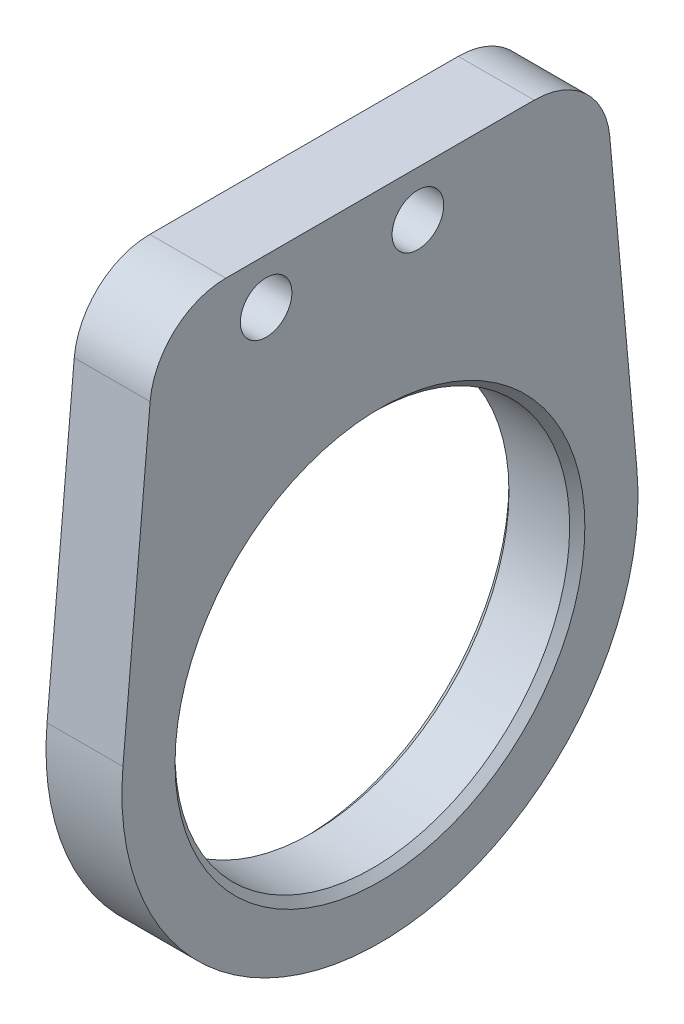
ISO-10303-21;
HEADER;
FILE_DESCRIPTION(('STEP AP214'),'2;1');
FILE_NAME('part.step','',(''),(''),'','','');
FILE_SCHEMA(('AUTOMOTIVE_DESIGN { 1 0 10303 214 1 1 1 1 }'));
ENDSEC;
DATA;
#1=APPLICATION_CONTEXT('core data for automotive mechanical design processes');
#2=APPLICATION_PROTOCOL_DEFINITION('international standard','automotive_design',2000,#1);
#3=PRODUCT_CONTEXT('',#1,'mechanical');
#4=PRODUCT('Part','Part','',(#3));
#5=PRODUCT_RELATED_PRODUCT_CATEGORY('part','',(#4));
#6=PRODUCT_DEFINITION_FORMATION('','',#4);
#7=PRODUCT_DEFINITION_CONTEXT('part definition',#1,'design');
#8=PRODUCT_DEFINITION('design','',#6,#7);
#9=PRODUCT_DEFINITION_SHAPE('','',#8);
#10=(LENGTH_UNIT() NAMED_UNIT(*) SI_UNIT(.MILLI.,.METRE.));
#11=(NAMED_UNIT(*) PLANE_ANGLE_UNIT() SI_UNIT($,.RADIAN.));
#12=(NAMED_UNIT(*) SI_UNIT($,.STERADIAN.) SOLID_ANGLE_UNIT());
#13=UNCERTAINTY_MEASURE_WITH_UNIT(LENGTH_MEASURE(1.E-05),#10,'distance_accuracy_value','');
#14=(GEOMETRIC_REPRESENTATION_CONTEXT(3) GLOBAL_UNCERTAINTY_ASSIGNED_CONTEXT((#13)) GLOBAL_UNIT_ASSIGNED_CONTEXT((#10,
#11,#12)) REPRESENTATION_CONTEXT('',''));
#15=CARTESIAN_POINT('',(0.,0.,0.));
#16=DIRECTION('',(0.,0.,1.));
#17=DIRECTION('',(1.,0.,0.));
#18=AXIS2_PLACEMENT_3D('',#15,#16,#17);
#19=CARTESIAN_POINT('',(0.,0.,0.));
#20=DIRECTION('',(1.,0.,0.));
#21=DIRECTION('',(0.,0.,-1.));
#22=AXIS2_PLACEMENT_3D('',#19,#20,#21);
#23=PLANE('',#22);
#24=CARTESIAN_POINT('',(0.,0.,0.));
#25=DIRECTION('',(1.,0.,0.));
#26=DIRECTION('',(0.,0.,-1.));
#27=AXIS2_PLACEMENT_3D('',#24,#25,#26);
#28=CIRCLE('',#27,13.5);
#29=CARTESIAN_POINT('',(0.,0.,-13.5));
#30=VERTEX_POINT('',#29);
#31=EDGE_CURVE('E145',#30,#30,#28,.T.);
#32=ORIENTED_EDGE('',*,*,#31,.T.);
#33=EDGE_LOOP('',(#32));
#34=FACE_BOUND('',#33,.T.);
#35=CARTESIAN_POINT('',(0.,23.,-2.49999999999997));
#36=DIRECTION('',(-1.,0.,0.));
#37=DIRECTION('',(0.,0.,1.));
#38=AXIS2_PLACEMENT_3D('',#35,#36,#37);
#39=CIRCLE('',#38,1.69999999999999);
#40=CARTESIAN_POINT('',(0.,23.,-0.799999999999981));
#41=VERTEX_POINT('',#40);
#42=EDGE_CURVE('E168',#41,#41,#39,.T.);
#43=ORIENTED_EDGE('',*,*,#42,.F.);
#44=EDGE_LOOP('',(#43));
#45=FACE_BOUND('',#44,.T.);
#46=DIRECTION('',(0.,-0.995979773230106,0.0895784087629744));
#47=VECTOR('',#46,1.);
#48=CARTESIAN_POINT('',(0.,1.52283294897057,16.9316561449118));
#49=LINE('',#48,#47);
#50=CARTESIAN_POINT('',(0.,21.4478920438149,15.1395965708144));
#51=VERTEX_POINT('',#50);
#52=CARTESIAN_POINT('',(0.,1.52283294897056,16.9316561449118));
#53=VERTEX_POINT('',#52);
#54=EDGE_CURVE('E119',#51,#53,#49,.T.);
#55=ORIENTED_EDGE('',*,*,#54,.F.);
#56=CARTESIAN_POINT('',(0.,21.,10.1596977046639));
#57=DIRECTION('',(1.,0.,0.));
#58=DIRECTION('',(0.,0.,-1.));
#59=AXIS2_PLACEMENT_3D('',#56,#57,#58);
#60=CIRCLE('',#59,5.);
#61=CARTESIAN_POINT('',(0.,26.,10.1596977046639));
#62=VERTEX_POINT('',#61);
#63=EDGE_CURVE('E134',#51,#62,#60,.F.);
#64=ORIENTED_EDGE('',*,*,#63,.T.);
#65=DIRECTION('',(0.,0.,-1.));
#66=VECTOR('',#65,1.);
#67=CARTESIAN_POINT('',(0.,26.,0.));
#68=LINE('',#67,#66);
#69=CARTESIAN_POINT('',(0.,26.,-10.1596977046639));
#70=VERTEX_POINT('',#69);
#71=EDGE_CURVE('E189',#62,#70,#68,.T.);
#72=ORIENTED_EDGE('',*,*,#71,.T.);
#73=CARTESIAN_POINT('',(0.,21.,-10.1596977046639));
#74=DIRECTION('',(1.,0.,0.));
#75=DIRECTION('',(0.,0.,-1.));
#76=AXIS2_PLACEMENT_3D('',#73,#74,#75);
#77=CIRCLE('',#76,5.);
#78=CARTESIAN_POINT('',(0.,21.4478920438149,-15.1395965708144));
#79=VERTEX_POINT('',#78);
#80=EDGE_CURVE('E128',#70,#79,#77,.F.);
#81=ORIENTED_EDGE('',*,*,#80,.T.);
#82=DIRECTION('',(0.,-0.995979773230106,-0.0895784087629746));
#83=VECTOR('',#82,1.);
#84=CARTESIAN_POINT('',(0.,1.52283294897057,-16.9316561449118));
#85=LINE('',#84,#83);
#86=CARTESIAN_POINT('',(0.,1.52283294897057,-16.9316561449118));
#87=VERTEX_POINT('',#86);
#88=EDGE_CURVE('E187',#79,#87,#85,.T.);
#89=ORIENTED_EDGE('',*,*,#88,.T.);
#90=CARTESIAN_POINT('',(0.,0.,0.));
#91=DIRECTION('',(1.,0.,0.));
#92=DIRECTION('',(0.,0.,-1.));
#93=AXIS2_PLACEMENT_3D('',#90,#91,#92);
#94=CIRCLE('',#93,17.);
#95=EDGE_CURVE('E123',#53,#87,#94,.T.);
#96=ORIENTED_EDGE('',*,*,#95,.F.);
#97=EDGE_LOOP('',(#55,#64,#72,#81,#89,#96));
#98=FACE_BOUND('',#97,.T.);
#99=CARTESIAN_POINT('',(0.,23.,7.50000000000003));
#100=DIRECTION('',(-1.,0.,0.));
#101=DIRECTION('',(0.,0.,1.));
#102=AXIS2_PLACEMENT_3D('',#99,#100,#101);
#103=CIRCLE('',#102,1.69999999999999);
#104=CARTESIAN_POINT('',(0.,23.,9.20000000000002));
#105=VERTEX_POINT('',#104);
#106=EDGE_CURVE('E173',#105,#105,#103,.T.);
#107=ORIENTED_EDGE('',*,*,#106,.F.);
#108=EDGE_LOOP('',(#107));
#109=FACE_BOUND('',#108,.T.);
#110=ADVANCED_FACE('F49',(#34,#45,#98,#109),#23,.F.);
#111=CARTESIAN_POINT('',(5.,0.,0.));
#112=DIRECTION('',(-1.,0.,0.));
#113=DIRECTION('',(0.,0.,1.));
#114=AXIS2_PLACEMENT_3D('',#111,#112,#113);
#115=CYLINDRICAL_SURFACE('',#114,17.);
#116=ORIENTED_EDGE('',*,*,#95,.T.);
#117=DIRECTION('',(-1.,0.,0.));
#118=VECTOR('',#117,1.);
#119=CARTESIAN_POINT('',(5.,1.52283294897057,-16.9316561449118));
#120=LINE('',#119,#118);
#121=CARTESIAN_POINT('',(5.,1.52283294897057,-16.9316561449118));
#122=VERTEX_POINT('',#121);
#123=EDGE_CURVE('E107',#122,#87,#120,.T.);
#124=ORIENTED_EDGE('',*,*,#123,.F.);
#125=CARTESIAN_POINT('',(5.,0.,0.));
#126=DIRECTION('',(1.,0.,0.));
#127=DIRECTION('',(0.,0.,-1.));
#128=AXIS2_PLACEMENT_3D('',#125,#126,#127);
#129=CIRCLE('',#128,17.);
#130=CARTESIAN_POINT('',(5.,1.52283294897056,16.9316561449118));
#131=VERTEX_POINT('',#130);
#132=EDGE_CURVE('E110',#131,#122,#129,.T.);
#133=ORIENTED_EDGE('',*,*,#132,.F.);
#134=DIRECTION('',(-1.,0.,0.));
#135=VECTOR('',#134,1.);
#136=CARTESIAN_POINT('',(5.,1.52283294897056,16.9316561449118));
#137=LINE('',#136,#135);
#138=EDGE_CURVE('E125',#131,#53,#137,.T.);
#139=ORIENTED_EDGE('',*,*,#138,.T.);
#140=EDGE_LOOP('',(#116,#124,#133,#139));
#141=FACE_BOUND('',#140,.T.);
#142=ADVANCED_FACE('F121',(#141),#115,.T.);
#143=CARTESIAN_POINT('',(5.,1.52283294897057,-16.9316561449118));
#144=DIRECTION('',(0.,0.0895784087629746,-0.995979773230106));
#145=DIRECTION('',(0.,0.995979773230106,0.0895784087629746));
#146=AXIS2_PLACEMENT_3D('',#143,#144,#145);
#147=PLANE('',#146);
#148=ORIENTED_EDGE('',*,*,#88,.F.);
#149=DIRECTION('',(-1.,0.,0.));
#150=VECTOR('',#149,1.);
#151=CARTESIAN_POINT('',(5.,21.4478920438149,-15.1395965708144));
#152=LINE('',#151,#150);
#153=CARTESIAN_POINT('',(5.,21.4478920438149,-15.1395965708144));
#154=VERTEX_POINT('',#153);
#155=EDGE_CURVE('E65',#79,#154,#152,.F.);
#156=ORIENTED_EDGE('',*,*,#155,.T.);
#157=DIRECTION('',(0.,-0.995979773230106,-0.0895784087629746));
#158=VECTOR('',#157,1.);
#159=CARTESIAN_POINT('',(5.,1.52283294897057,-16.9316561449118));
#160=LINE('',#159,#158);
#161=EDGE_CURVE('E103',#154,#122,#160,.T.);
#162=ORIENTED_EDGE('',*,*,#161,.T.);
#163=ORIENTED_EDGE('',*,*,#123,.T.);
#164=EDGE_LOOP('',(#148,#156,#162,#163));
#165=FACE_BOUND('',#164,.T.);
#166=ADVANCED_FACE('F105',(#165),#147,.T.);
#167=CARTESIAN_POINT('',(5.,26.,0.));
#168=DIRECTION('',(0.,1.,0.));
#169=DIRECTION('',(0.,0.,1.));
#170=AXIS2_PLACEMENT_3D('',#167,#168,#169);
#171=PLANE('',#170);
#172=ORIENTED_EDGE('',*,*,#71,.F.);
#173=DIRECTION('',(-1.,0.,0.));
#174=VECTOR('',#173,1.);
#175=CARTESIAN_POINT('',(5.,26.,10.1596977046639));
#176=LINE('',#175,#174);
#177=CARTESIAN_POINT('',(5.,26.,10.1596977046639));
#178=VERTEX_POINT('',#177);
#179=EDGE_CURVE('E139',#62,#178,#176,.F.);
#180=ORIENTED_EDGE('',*,*,#179,.T.);
#181=DIRECTION('',(0.,0.,-1.));
#182=VECTOR('',#181,1.);
#183=CARTESIAN_POINT('',(5.,26.,0.));
#184=LINE('',#183,#182);
#185=CARTESIAN_POINT('',(5.,26.,-10.1596977046639));
#186=VERTEX_POINT('',#185);
#187=EDGE_CURVE('E109',#178,#186,#184,.T.);
#188=ORIENTED_EDGE('',*,*,#187,.T.);
#189=DIRECTION('',(-1.,0.,0.));
#190=VECTOR('',#189,1.);
#191=CARTESIAN_POINT('',(5.,26.,-10.1596977046639));
#192=LINE('',#191,#190);
#193=EDGE_CURVE('E136',#186,#70,#192,.T.);
#194=ORIENTED_EDGE('',*,*,#193,.T.);
#195=EDGE_LOOP('',(#172,#180,#188,#194));
#196=FACE_BOUND('',#195,.T.);
#197=ADVANCED_FACE('F199',(#196),#171,.T.);
#198=CARTESIAN_POINT('',(5.,0.,0.));
#199=DIRECTION('',(-1.,0.,0.));
#200=DIRECTION('',(0.,0.,1.));
#201=AXIS2_PLACEMENT_3D('',#198,#199,#200);
#202=CYLINDRICAL_SURFACE('',#201,13.);
#203=CARTESIAN_POINT('',(0.5,0.,0.));
#204=DIRECTION('',(1.,0.,0.));
#205=DIRECTION('',(0.,0.,-1.));
#206=AXIS2_PLACEMENT_3D('',#203,#204,#205);
#207=CIRCLE('',#206,13.);
#208=CARTESIAN_POINT('',(0.5,0.,-13.));
#209=VERTEX_POINT('',#208);
#210=EDGE_CURVE('E58',#209,#209,#207,.F.);
#211=ORIENTED_EDGE('',*,*,#210,.T.);
#212=EDGE_LOOP('',(#211));
#213=FACE_BOUND('',#212,.T.);
#214=CARTESIAN_POINT('',(4.49999999999999,0.,0.));
#215=DIRECTION('',(1.,0.,0.));
#216=DIRECTION('',(0.,0.,-1.));
#217=AXIS2_PLACEMENT_3D('',#214,#215,#216);
#218=CIRCLE('',#217,13.);
#219=CARTESIAN_POINT('',(4.49999999999999,0.,-13.));
#220=VERTEX_POINT('',#219);
#221=EDGE_CURVE('E148',#220,#220,#218,.T.);
#222=ORIENTED_EDGE('',*,*,#221,.T.);
#223=EDGE_LOOP('',(#222));
#224=FACE_BOUND('',#223,.T.);
#225=ADVANCED_FACE('F153',(#213,#224),#202,.F.);
#226=CARTESIAN_POINT('',(5.,1.52283294897057,16.9316561449118));
#227=DIRECTION('',(0.,-0.0895784087629744,-0.995979773230106));
#228=DIRECTION('',(0.,0.995979773230106,-0.0895784087629744));
#229=AXIS2_PLACEMENT_3D('',#226,#227,#228);
#230=PLANE('',#229);
#231=DIRECTION('',(0.,-0.995979773230106,0.0895784087629744));
#232=VECTOR('',#231,1.);
#233=CARTESIAN_POINT('',(5.,1.52283294897057,16.9316561449118));
#234=LINE('',#233,#232);
#235=CARTESIAN_POINT('',(5.,21.4478920438149,15.1395965708144));
#236=VERTEX_POINT('',#235);
#237=EDGE_CURVE('E115',#236,#131,#234,.T.);
#238=ORIENTED_EDGE('',*,*,#237,.F.);
#239=DIRECTION('',(-1.,0.,0.));
#240=VECTOR('',#239,1.);
#241=CARTESIAN_POINT('',(0.,21.4478920438149,15.1395965708144));
#242=LINE('',#241,#240);
#243=EDGE_CURVE('E124',#236,#51,#242,.T.);
#244=ORIENTED_EDGE('',*,*,#243,.T.);
#245=ORIENTED_EDGE('',*,*,#54,.T.);
#246=ORIENTED_EDGE('',*,*,#138,.F.);
#247=EDGE_LOOP('',(#238,#244,#245,#246));
#248=FACE_BOUND('',#247,.T.);
#249=ADVANCED_FACE('F192',(#248),#230,.F.);
#250=CARTESIAN_POINT('',(5.,0.,0.));
#251=DIRECTION('',(1.,0.,0.));
#252=DIRECTION('',(0.,0.,-1.));
#253=AXIS2_PLACEMENT_3D('',#250,#251,#252);
#254=PLANE('',#253);
#255=CARTESIAN_POINT('',(5.,0.,0.));
#256=DIRECTION('',(1.,0.,0.));
#257=DIRECTION('',(0.,0.,-1.));
#258=AXIS2_PLACEMENT_3D('',#255,#256,#257);
#259=CIRCLE('',#258,13.5);
#260=CARTESIAN_POINT('',(5.,0.,-13.5));
#261=VERTEX_POINT('',#260);
#262=EDGE_CURVE('E11',#261,#261,#259,.F.);
#263=ORIENTED_EDGE('',*,*,#262,.T.);
#264=EDGE_LOOP('',(#263));
#265=FACE_BOUND('',#264,.T.);
#266=CARTESIAN_POINT('',(5.,23.,-2.49999999999997));
#267=DIRECTION('',(-1.,0.,0.));
#268=DIRECTION('',(0.,0.,1.));
#269=AXIS2_PLACEMENT_3D('',#266,#267,#268);
#270=CIRCLE('',#269,1.69999999999999);
#271=CARTESIAN_POINT('',(5.,23.,-0.799999999999981));
#272=VERTEX_POINT('',#271);
#273=EDGE_CURVE('E176',#272,#272,#270,.T.);
#274=ORIENTED_EDGE('',*,*,#273,.T.);
#275=EDGE_LOOP('',(#274));
#276=FACE_BOUND('',#275,.T.);
#277=CARTESIAN_POINT('',(5.,23.,7.50000000000003));
#278=DIRECTION('',(-1.,0.,0.));
#279=DIRECTION('',(0.,0.,1.));
#280=AXIS2_PLACEMENT_3D('',#277,#278,#279);
#281=CIRCLE('',#280,1.69999999999999);
#282=CARTESIAN_POINT('',(5.,23.,9.20000000000002));
#283=VERTEX_POINT('',#282);
#284=EDGE_CURVE('E175',#283,#283,#281,.T.);
#285=ORIENTED_EDGE('',*,*,#284,.T.);
#286=EDGE_LOOP('',(#285));
#287=FACE_BOUND('',#286,.T.);
#288=ORIENTED_EDGE('',*,*,#187,.F.);
#289=CARTESIAN_POINT('',(5.,21.,10.1596977046639));
#290=DIRECTION('',(1.,0.,0.));
#291=DIRECTION('',(0.,0.,-1.));
#292=AXIS2_PLACEMENT_3D('',#289,#290,#291);
#293=CIRCLE('',#292,5.);
#294=EDGE_CURVE('E142',#178,#236,#293,.T.);
#295=ORIENTED_EDGE('',*,*,#294,.T.);
#296=ORIENTED_EDGE('',*,*,#237,.T.);
#297=ORIENTED_EDGE('',*,*,#132,.T.);
#298=ORIENTED_EDGE('',*,*,#161,.F.);
#299=CARTESIAN_POINT('',(5.,21.,-10.1596977046639));
#300=DIRECTION('',(1.,0.,0.));
#301=DIRECTION('',(0.,0.,-1.));
#302=AXIS2_PLACEMENT_3D('',#299,#300,#301);
#303=CIRCLE('',#302,5.);
#304=EDGE_CURVE('E72',#154,#186,#303,.T.);
#305=ORIENTED_EDGE('',*,*,#304,.T.);
#306=EDGE_LOOP('',(#288,#295,#296,#297,#298,#305));
#307=FACE_BOUND('',#306,.T.);
#308=ADVANCED_FACE('F113',(#265,#276,#287,#307),#254,.T.);
#309=CARTESIAN_POINT('',(5.,21.,10.1596977046639));
#310=DIRECTION('',(1.,0.,0.));
#311=DIRECTION('',(0.,0.,-1.));
#312=AXIS2_PLACEMENT_3D('',#309,#310,#311);
#313=CYLINDRICAL_SURFACE('',#312,5.);
#314=ORIENTED_EDGE('',*,*,#294,.F.);
#315=ORIENTED_EDGE('',*,*,#179,.F.);
#316=ORIENTED_EDGE('',*,*,#63,.F.);
#317=ORIENTED_EDGE('',*,*,#243,.F.);
#318=EDGE_LOOP('',(#314,#315,#316,#317));
#319=FACE_BOUND('',#318,.T.);
#320=ADVANCED_FACE('F203',(#319),#313,.T.);
#321=CARTESIAN_POINT('',(5.,21.,-10.1596977046639));
#322=DIRECTION('',(-1.,0.,0.));
#323=DIRECTION('',(0.,0.,1.));
#324=AXIS2_PLACEMENT_3D('',#321,#322,#323);
#325=CYLINDRICAL_SURFACE('',#324,5.);
#326=ORIENTED_EDGE('',*,*,#304,.F.);
#327=ORIENTED_EDGE('',*,*,#155,.F.);
#328=ORIENTED_EDGE('',*,*,#80,.F.);
#329=ORIENTED_EDGE('',*,*,#193,.F.);
#330=EDGE_LOOP('',(#326,#327,#328,#329));
#331=FACE_BOUND('',#330,.T.);
#332=ADVANCED_FACE('F195',(#331),#325,.T.);
#333=CARTESIAN_POINT('',(0.,23.,7.50000000000003));
#334=DIRECTION('',(-1.,0.,0.));
#335=DIRECTION('',(0.,0.,1.));
#336=AXIS2_PLACEMENT_3D('',#333,#334,#335);
#337=CYLINDRICAL_SURFACE('',#336,1.69999999999999);
#338=ORIENTED_EDGE('',*,*,#284,.F.);
#339=EDGE_LOOP('',(#338));
#340=FACE_BOUND('',#339,.T.);
#341=ORIENTED_EDGE('',*,*,#106,.T.);
#342=EDGE_LOOP('',(#341));
#343=FACE_BOUND('',#342,.T.);
#344=ADVANCED_FACE('F210',(#340,#343),#337,.F.);
#345=CARTESIAN_POINT('',(0.,23.,-2.49999999999997));
#346=DIRECTION('',(-1.,0.,0.));
#347=DIRECTION('',(0.,0.,1.));
#348=AXIS2_PLACEMENT_3D('',#345,#346,#347);
#349=CYLINDRICAL_SURFACE('',#348,1.69999999999999);
#350=ORIENTED_EDGE('',*,*,#273,.F.);
#351=EDGE_LOOP('',(#350));
#352=FACE_BOUND('',#351,.T.);
#353=ORIENTED_EDGE('',*,*,#42,.T.);
#354=EDGE_LOOP('',(#353));
#355=FACE_BOUND('',#354,.T.);
#356=ADVANCED_FACE('F159',(#352,#355),#349,.F.);
#357=CARTESIAN_POINT('',(0.,0.,0.));
#358=DIRECTION('',(-1.,0.,0.));
#359=DIRECTION('',(0.,0.,1.));
#360=AXIS2_PLACEMENT_3D('',#357,#358,#359);
#361=CONICAL_SURFACE('',#360,13.5,0.785398163397445);
#362=ORIENTED_EDGE('',*,*,#210,.F.);
#363=EDGE_LOOP('',(#362));
#364=FACE_BOUND('',#363,.T.);
#365=ORIENTED_EDGE('',*,*,#31,.F.);
#366=EDGE_LOOP('',(#365));
#367=FACE_BOUND('',#366,.T.);
#368=ADVANCED_FACE('F156',(#364,#367),#361,.F.);
#369=CARTESIAN_POINT('',(4.49999999999999,0.,0.));
#370=DIRECTION('',(1.,0.,0.));
#371=DIRECTION('',(0.,0.,-1.));
#372=AXIS2_PLACEMENT_3D('',#369,#370,#371);
#373=CONICAL_SURFACE('',#372,13.,0.785398163397453);
#374=ORIENTED_EDGE('',*,*,#262,.F.);
#375=EDGE_LOOP('',(#374));
#376=FACE_BOUND('',#375,.T.);
#377=ORIENTED_EDGE('',*,*,#221,.F.);
#378=EDGE_LOOP('',(#377));
#379=FACE_BOUND('',#378,.T.);
#380=ADVANCED_FACE('F52',(#376,#379),#373,.F.);
#381=CLOSED_SHELL('',(#110,#142,#166,#197,#225,#249,#308,#320,#332,#344,#356,#368,#380));
#382=MANIFOLD_SOLID_BREP('B2',#381);
#383=ADVANCED_BREP_SHAPE_REPRESENTATION('',(#18,#382),#14);
#384=SHAPE_DEFINITION_REPRESENTATION(#9,#383);
ENDSEC;
END-ISO-10303-21;
